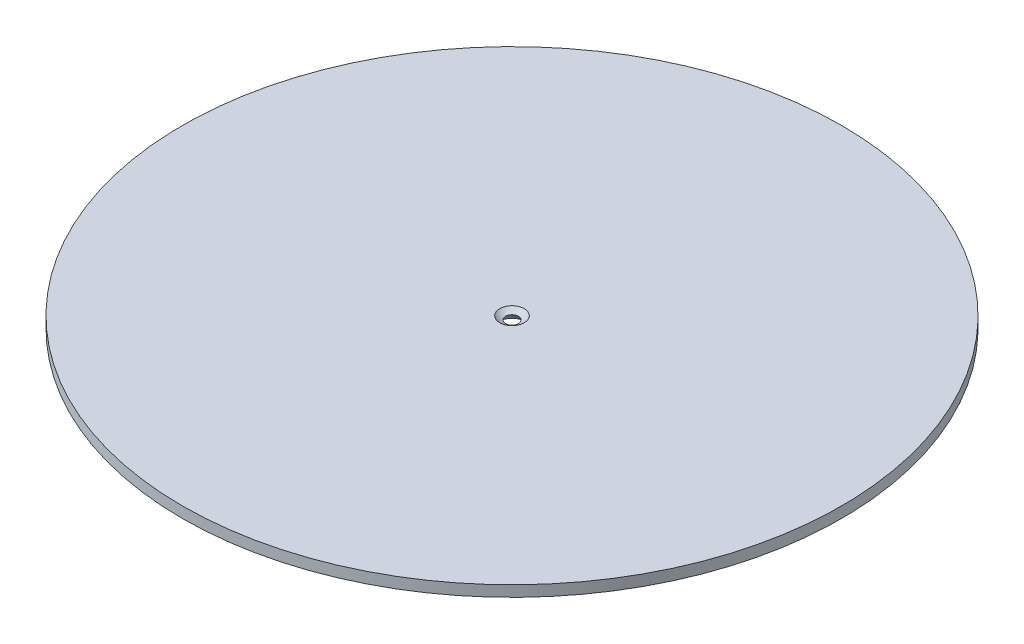
ISO-10303-21;
HEADER;
FILE_DESCRIPTION(('STEP AP214'),'2;1');
FILE_NAME('part.step','',(''),(''),'','','');
FILE_SCHEMA(('AUTOMOTIVE_DESIGN { 1 0 10303 214 1 1 1 1 }'));
ENDSEC;
DATA;
#1=APPLICATION_CONTEXT('core data for automotive mechanical design processes');
#2=APPLICATION_PROTOCOL_DEFINITION('international standard','automotive_design',2000,#1);
#3=PRODUCT_CONTEXT('',#1,'mechanical');
#4=PRODUCT('Part','Part','',(#3));
#5=PRODUCT_RELATED_PRODUCT_CATEGORY('part','',(#4));
#6=PRODUCT_DEFINITION_FORMATION('','',#4);
#7=PRODUCT_DEFINITION_CONTEXT('part definition',#1,'design');
#8=PRODUCT_DEFINITION('design','',#6,#7);
#9=PRODUCT_DEFINITION_SHAPE('','',#8);
#10=(LENGTH_UNIT() NAMED_UNIT(*) SI_UNIT(.MILLI.,.METRE.));
#11=(NAMED_UNIT(*) PLANE_ANGLE_UNIT() SI_UNIT($,.RADIAN.));
#12=(NAMED_UNIT(*) SI_UNIT($,.STERADIAN.) SOLID_ANGLE_UNIT());
#13=UNCERTAINTY_MEASURE_WITH_UNIT(LENGTH_MEASURE(1.E-05),#10,'distance_accuracy_value','');
#14=(GEOMETRIC_REPRESENTATION_CONTEXT(3) GLOBAL_UNCERTAINTY_ASSIGNED_CONTEXT((#13)) GLOBAL_UNIT_ASSIGNED_CONTEXT((#10,
#11,#12)) REPRESENTATION_CONTEXT('',''));
#15=CARTESIAN_POINT('',(0.,0.,0.));
#16=DIRECTION('',(0.,0.,1.));
#17=DIRECTION('',(1.,0.,0.));
#18=AXIS2_PLACEMENT_3D('',#15,#16,#17);
#19=CARTESIAN_POINT('',(0.,38.1,0.));
#20=DIRECTION('',(0.,-1.,0.));
#21=DIRECTION('',(0.,0.,-1.));
#22=AXIS2_PLACEMENT_3D('',#19,#20,#21);
#23=CYLINDRICAL_SURFACE('',#22,1150.00024);
#24=CARTESIAN_POINT('',(0.,38.1,0.));
#25=DIRECTION('',(0.,1.,0.));
#26=DIRECTION('',(0.,0.,1.));
#27=AXIS2_PLACEMENT_3D('',#24,#25,#26);
#28=CIRCLE('',#27,1150.00024);
#29=CARTESIAN_POINT('',(0.,38.1,1150.00024));
#30=VERTEX_POINT('',#29);
#31=EDGE_CURVE('E10',#30,#30,#28,.T.);
#32=ORIENTED_EDGE('',*,*,#31,.F.);
#33=EDGE_LOOP('',(#32));
#34=FACE_BOUND('',#33,.T.);
#35=CARTESIAN_POINT('',(0.,0.,0.));
#36=DIRECTION('',(0.,1.,0.));
#37=DIRECTION('',(0.,0.,1.));
#38=AXIS2_PLACEMENT_3D('',#35,#36,#37);
#39=CIRCLE('',#38,1150.00024);
#40=CARTESIAN_POINT('',(0.,0.,1150.00024));
#41=VERTEX_POINT('',#40);
#42=EDGE_CURVE('E44',#41,#41,#39,.T.);
#43=ORIENTED_EDGE('',*,*,#42,.T.);
#44=EDGE_LOOP('',(#43));
#45=FACE_BOUND('',#44,.T.);
#46=ADVANCED_FACE('F41',(#34,#45),#23,.T.);
#47=CARTESIAN_POINT('',(0.,38.1,0.));
#48=DIRECTION('',(0.,1.,0.));
#49=DIRECTION('',(0.,0.,1.));
#50=AXIS2_PLACEMENT_3D('',#47,#48,#49);
#51=PLANE('',#50);
#52=CARTESIAN_POINT('',(0.,38.1000000000002,0.));
#53=DIRECTION('',(0.,-1.,0.));
#54=DIRECTION('',(0.,0.,-1.));
#55=AXIS2_PLACEMENT_3D('',#52,#53,#54);
#56=CIRCLE('',#55,42.7041128880161);
#57=CARTESIAN_POINT('',(0.,38.1000000000002,-42.7041128880161));
#58=VERTEX_POINT('',#57);
#59=EDGE_CURVE('E62',#58,#58,#56,.T.);
#60=ORIENTED_EDGE('',*,*,#59,.T.);
#61=EDGE_LOOP('',(#60));
#62=FACE_BOUND('',#61,.T.);
#63=ORIENTED_EDGE('',*,*,#31,.T.);
#64=EDGE_LOOP('',(#63));
#65=FACE_BOUND('',#64,.T.);
#66=ADVANCED_FACE('F67',(#62,#65),#51,.T.);
#67=CARTESIAN_POINT('',(0.,0.,0.));
#68=DIRECTION('',(0.,1.,0.));
#69=DIRECTION('',(0.,0.,1.));
#70=AXIS2_PLACEMENT_3D('',#67,#68,#69);
#71=PLANE('',#70);
#72=CARTESIAN_POINT('',(0.,0.,0.));
#73=DIRECTION('',(0.,-1.,0.));
#74=DIRECTION('',(0.,0.,-1.));
#75=AXIS2_PLACEMENT_3D('',#72,#73,#74);
#76=CIRCLE('',#75,42.7041128880161);
#77=CARTESIAN_POINT('',(0.,0.,-42.7041128880161));
#78=VERTEX_POINT('',#77);
#79=EDGE_CURVE('E53',#78,#78,#76,.T.);
#80=ORIENTED_EDGE('',*,*,#79,.F.);
#81=EDGE_LOOP('',(#80));
#82=FACE_BOUND('',#81,.T.);
#83=ORIENTED_EDGE('',*,*,#42,.F.);
#84=EDGE_LOOP('',(#83));
#85=FACE_BOUND('',#84,.T.);
#86=ADVANCED_FACE('F78',(#82,#85),#71,.F.);
#87=CARTESIAN_POINT('',(0.,-26.3607142448377,0.));
#88=DIRECTION('',(0.,-1.,0.));
#89=DIRECTION('',(0.,0.,-1.));
#90=AXIS2_PLACEMENT_3D('',#87,#88,#89);
#91=DEGENERATE_TOROIDAL_SURFACE('',#90,15.9295925766417,64.2868468041032,.F.);
#92=CARTESIAN_POINT('',(0.,25.3376754777522,0.));
#93=DIRECTION('',(0.,-1.,0.));
#94=DIRECTION('',(0.,0.,-1.));
#95=AXIS2_PLACEMENT_3D('',#92,#93,#94);
#96=CIRCLE('',#95,22.2813374317399);
#97=CARTESIAN_POINT('',(0.,25.3376754777522,-22.2813374317399));
#98=VERTEX_POINT('',#97);
#99=EDGE_CURVE('E58',#98,#98,#96,.T.);
#100=ORIENTED_EDGE('',*,*,#99,.F.);
#101=EDGE_LOOP('',(#100));
#102=FACE_BOUND('',#101,.T.);
#103=ORIENTED_EDGE('',*,*,#79,.T.);
#104=EDGE_LOOP('',(#103));
#105=FACE_BOUND('',#104,.T.);
#106=ADVANCED_FACE('F72',(#102,#105),#91,.T.);
#107=CARTESIAN_POINT('',(0.,88.9624303949368,0.));
#108=DIRECTION('',(0.,-1.,0.));
#109=DIRECTION('',(0.,0.,-1.));
#110=AXIS2_PLACEMENT_3D('',#107,#108,#109);
#111=DEGENERATE_TOROIDAL_SURFACE('',#110,3.27916626888974,68.5671115601474,.F.);
#112=ORIENTED_EDGE('',*,*,#59,.F.);
#113=EDGE_LOOP('',(#112));
#114=FACE_BOUND('',#113,.T.);
#115=ORIENTED_EDGE('',*,*,#99,.T.);
#116=EDGE_LOOP('',(#115));
#117=FACE_BOUND('',#116,.T.);
#118=ADVANCED_FACE('F69',(#114,#117),#111,.T.);
#119=CLOSED_SHELL('',(#46,#66,#86,#106,#118));
#120=MANIFOLD_SOLID_BREP('B2',#119);
#121=ADVANCED_BREP_SHAPE_REPRESENTATION('',(#18,#120),#14);
#122=SHAPE_DEFINITION_REPRESENTATION(#9,#121);
ENDSEC;
END-ISO-10303-21;
